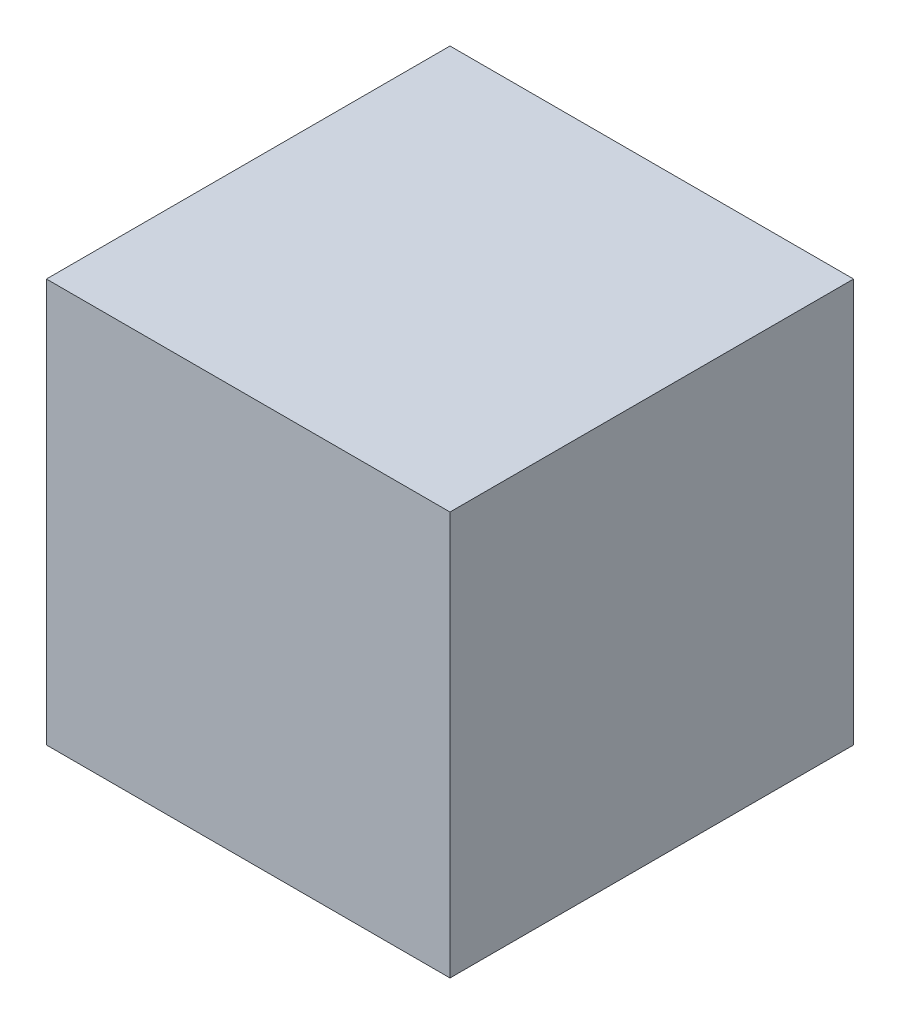
ISO-10303-21;
HEADER;
FILE_DESCRIPTION(('STEP AP214'),'2;1');
FILE_NAME('part.step','',(''),(''),'','','');
FILE_SCHEMA(('AUTOMOTIVE_DESIGN { 1 0 10303 214 1 1 1 1 }'));
ENDSEC;
DATA;
#1=APPLICATION_CONTEXT('core data for automotive mechanical design processes');
#2=APPLICATION_PROTOCOL_DEFINITION('international standard','automotive_design',2000,#1);
#3=PRODUCT_CONTEXT('',#1,'mechanical');
#4=PRODUCT('Part','Part','',(#3));
#5=PRODUCT_RELATED_PRODUCT_CATEGORY('part','',(#4));
#6=PRODUCT_DEFINITION_FORMATION('','',#4);
#7=PRODUCT_DEFINITION_CONTEXT('part definition',#1,'design');
#8=PRODUCT_DEFINITION('design','',#6,#7);
#9=PRODUCT_DEFINITION_SHAPE('','',#8);
#10=(LENGTH_UNIT() NAMED_UNIT(*) SI_UNIT(.MILLI.,.METRE.));
#11=(NAMED_UNIT(*) PLANE_ANGLE_UNIT() SI_UNIT($,.RADIAN.));
#12=(NAMED_UNIT(*) SI_UNIT($,.STERADIAN.) SOLID_ANGLE_UNIT());
#13=UNCERTAINTY_MEASURE_WITH_UNIT(LENGTH_MEASURE(1.E-05),#10,'distance_accuracy_value','');
#14=(GEOMETRIC_REPRESENTATION_CONTEXT(3) GLOBAL_UNCERTAINTY_ASSIGNED_CONTEXT((#13)) GLOBAL_UNIT_ASSIGNED_CONTEXT((#10,
#11,#12)) REPRESENTATION_CONTEXT('',''));
#15=CARTESIAN_POINT('',(0.,0.,0.));
#16=DIRECTION('',(0.,0.,1.));
#17=DIRECTION('',(1.,0.,0.));
#18=AXIS2_PLACEMENT_3D('',#15,#16,#17);
#19=CARTESIAN_POINT('',(25.4,25.4,25.4));
#20=DIRECTION('',(-1.,0.,0.));
#21=DIRECTION('',(0.,0.,1.));
#22=AXIS2_PLACEMENT_3D('',#19,#20,#21);
#23=PLANE('',#22);
#24=DIRECTION('',(0.,0.,-1.));
#25=VECTOR('',#24,1.);
#26=CARTESIAN_POINT('',(25.4,-25.4,25.4));
#27=LINE('',#26,#25);
#28=CARTESIAN_POINT('',(25.4,-25.4,25.4));
#29=VERTEX_POINT('',#28);
#30=CARTESIAN_POINT('',(25.4,-25.4,-25.4));
#31=VERTEX_POINT('',#30);
#32=EDGE_CURVE('E107',#29,#31,#27,.T.);
#33=ORIENTED_EDGE('',*,*,#32,.T.);
#34=DIRECTION('',(0.,-1.,0.));
#35=VECTOR('',#34,1.);
#36=CARTESIAN_POINT('',(25.4,25.4,-25.4));
#37=LINE('',#36,#35);
#38=CARTESIAN_POINT('',(25.4,25.4,-25.4));
#39=VERTEX_POINT('',#38);
#40=EDGE_CURVE('E11',#39,#31,#37,.T.);
#41=ORIENTED_EDGE('',*,*,#40,.F.);
#42=DIRECTION('',(0.,0.,-1.));
#43=VECTOR('',#42,1.);
#44=CARTESIAN_POINT('',(25.4,25.4,25.4));
#45=LINE('',#44,#43);
#46=CARTESIAN_POINT('',(25.4,25.4,25.4));
#47=VERTEX_POINT('',#46);
#48=EDGE_CURVE('E91',#47,#39,#45,.T.);
#49=ORIENTED_EDGE('',*,*,#48,.F.);
#50=DIRECTION('',(0.,-1.,0.));
#51=VECTOR('',#50,1.);
#52=CARTESIAN_POINT('',(25.4,25.4,25.4));
#53=LINE('',#52,#51);
#54=EDGE_CURVE('E103',#47,#29,#53,.T.);
#55=ORIENTED_EDGE('',*,*,#54,.T.);
#56=EDGE_LOOP('',(#33,#41,#49,#55));
#57=FACE_BOUND('',#56,.T.);
#58=ADVANCED_FACE('F39',(#57),#23,.F.);
#59=CARTESIAN_POINT('',(-25.4,25.4,-25.4));
#60=DIRECTION('',(0.,0.,1.));
#61=DIRECTION('',(1.,0.,0.));
#62=AXIS2_PLACEMENT_3D('',#59,#60,#61);
#63=PLANE('',#62);
#64=DIRECTION('',(-1.,0.,0.));
#65=VECTOR('',#64,1.);
#66=CARTESIAN_POINT('',(-25.4,-25.4,-25.4));
#67=LINE('',#66,#65);
#68=CARTESIAN_POINT('',(-25.4,-25.4,-25.4));
#69=VERTEX_POINT('',#68);
#70=EDGE_CURVE('E96',#31,#69,#67,.T.);
#71=ORIENTED_EDGE('',*,*,#70,.T.);
#72=DIRECTION('',(0.,-1.,0.));
#73=VECTOR('',#72,1.);
#74=CARTESIAN_POINT('',(-25.4,25.4,-25.4));
#75=LINE('',#74,#73);
#76=CARTESIAN_POINT('',(-25.4,25.4,-25.4));
#77=VERTEX_POINT('',#76);
#78=EDGE_CURVE('E48',#77,#69,#75,.T.);
#79=ORIENTED_EDGE('',*,*,#78,.F.);
#80=DIRECTION('',(-1.,0.,0.));
#81=VECTOR('',#80,1.);
#82=CARTESIAN_POINT('',(-25.4,25.4,-25.4));
#83=LINE('',#82,#81);
#84=EDGE_CURVE('E86',#39,#77,#83,.T.);
#85=ORIENTED_EDGE('',*,*,#84,.F.);
#86=ORIENTED_EDGE('',*,*,#40,.T.);
#87=EDGE_LOOP('',(#71,#79,#85,#86));
#88=FACE_BOUND('',#87,.T.);
#89=ADVANCED_FACE('F95',(#88),#63,.F.);
#90=CARTESIAN_POINT('',(-25.4,25.4,25.4));
#91=DIRECTION('',(1.,0.,0.));
#92=DIRECTION('',(0.,0.,-1.));
#93=AXIS2_PLACEMENT_3D('',#90,#91,#92);
#94=PLANE('',#93);
#95=DIRECTION('',(0.,0.,1.));
#96=VECTOR('',#95,1.);
#97=CARTESIAN_POINT('',(-25.4,-25.4,25.4));
#98=LINE('',#97,#96);
#99=CARTESIAN_POINT('',(-25.4,-25.4,25.4));
#100=VERTEX_POINT('',#99);
#101=EDGE_CURVE('E73',#69,#100,#98,.T.);
#102=ORIENTED_EDGE('',*,*,#101,.T.);
#103=DIRECTION('',(0.,-1.,0.));
#104=VECTOR('',#103,1.);
#105=CARTESIAN_POINT('',(-25.4,25.4,25.4));
#106=LINE('',#105,#104);
#107=CARTESIAN_POINT('',(-25.4,25.4,25.4));
#108=VERTEX_POINT('',#107);
#109=EDGE_CURVE('E98',#108,#100,#106,.T.);
#110=ORIENTED_EDGE('',*,*,#109,.F.);
#111=DIRECTION('',(0.,0.,1.));
#112=VECTOR('',#111,1.);
#113=CARTESIAN_POINT('',(-25.4,25.4,25.4));
#114=LINE('',#113,#112);
#115=EDGE_CURVE('E89',#77,#108,#114,.T.);
#116=ORIENTED_EDGE('',*,*,#115,.F.);
#117=ORIENTED_EDGE('',*,*,#78,.T.);
#118=EDGE_LOOP('',(#102,#110,#116,#117));
#119=FACE_BOUND('',#118,.T.);
#120=ADVANCED_FACE('F99',(#119),#94,.F.);
#121=CARTESIAN_POINT('',(-25.4,25.4,25.4));
#122=DIRECTION('',(0.,0.,-1.));
#123=DIRECTION('',(-1.,0.,0.));
#124=AXIS2_PLACEMENT_3D('',#121,#122,#123);
#125=PLANE('',#124);
#126=DIRECTION('',(1.,0.,0.));
#127=VECTOR('',#126,1.);
#128=CARTESIAN_POINT('',(-25.4,-25.4,25.4));
#129=LINE('',#128,#127);
#130=EDGE_CURVE('E79',#100,#29,#129,.T.);
#131=ORIENTED_EDGE('',*,*,#130,.T.);
#132=ORIENTED_EDGE('',*,*,#54,.F.);
#133=DIRECTION('',(1.,0.,0.));
#134=VECTOR('',#133,1.);
#135=CARTESIAN_POINT('',(-25.4,25.4,25.4));
#136=LINE('',#135,#134);
#137=EDGE_CURVE('E56',#108,#47,#136,.T.);
#138=ORIENTED_EDGE('',*,*,#137,.F.);
#139=ORIENTED_EDGE('',*,*,#109,.T.);
#140=EDGE_LOOP('',(#131,#132,#138,#139));
#141=FACE_BOUND('',#140,.T.);
#142=ADVANCED_FACE('F120',(#141),#125,.F.);
#143=CARTESIAN_POINT('',(0.,25.4,0.));
#144=DIRECTION('',(0.,-1.,0.));
#145=DIRECTION('',(0.,0.,-1.));
#146=AXIS2_PLACEMENT_3D('',#143,#144,#145);
#147=PLANE('',#146);
#148=ORIENTED_EDGE('',*,*,#48,.T.);
#149=ORIENTED_EDGE('',*,*,#84,.T.);
#150=ORIENTED_EDGE('',*,*,#115,.T.);
#151=ORIENTED_EDGE('',*,*,#137,.T.);
#152=EDGE_LOOP('',(#148,#149,#150,#151));
#153=FACE_BOUND('',#152,.T.);
#154=ADVANCED_FACE('F87',(#153),#147,.F.);
#155=CARTESIAN_POINT('',(0.,-25.4,0.));
#156=DIRECTION('',(0.,-1.,0.));
#157=DIRECTION('',(0.,0.,-1.));
#158=AXIS2_PLACEMENT_3D('',#155,#156,#157);
#159=PLANE('',#158);
#160=ORIENTED_EDGE('',*,*,#32,.F.);
#161=ORIENTED_EDGE('',*,*,#130,.F.);
#162=ORIENTED_EDGE('',*,*,#101,.F.);
#163=ORIENTED_EDGE('',*,*,#70,.F.);
#164=EDGE_LOOP('',(#160,#161,#162,#163));
#165=FACE_BOUND('',#164,.T.);
#166=ADVANCED_FACE('F123',(#165),#159,.T.);
#167=CLOSED_SHELL('',(#58,#89,#120,#142,#154,#166));
#168=MANIFOLD_SOLID_BREP('B2',#167);
#169=ADVANCED_BREP_SHAPE_REPRESENTATION('',(#18,#168),#14);
#170=SHAPE_DEFINITION_REPRESENTATION(#9,#169);
ENDSEC;
END-ISO-10303-21;
